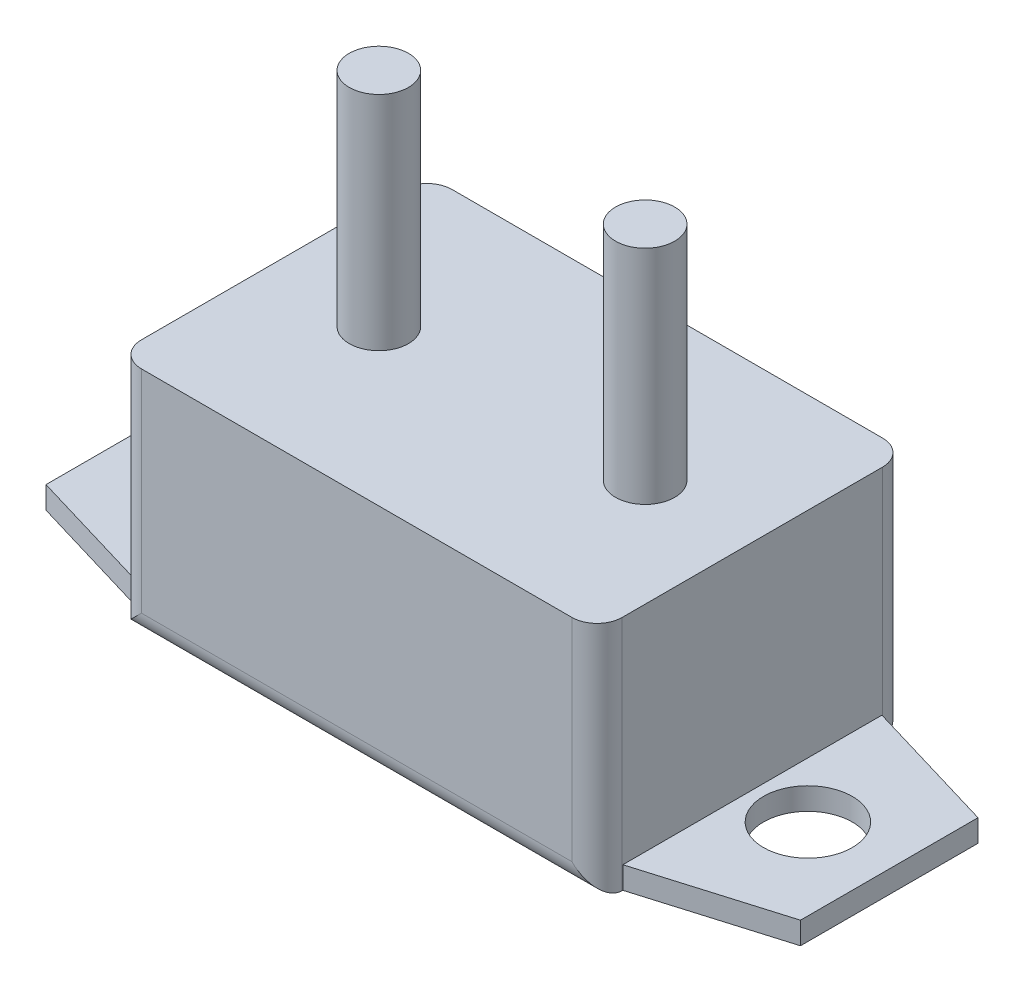
ISO-10303-21;
HEADER;
FILE_DESCRIPTION(('STEP AP214'),'2;1');
FILE_NAME('part.step','',(''),(''),'','','');
FILE_SCHEMA(('AUTOMOTIVE_DESIGN { 1 0 10303 214 1 1 1 1 }'));
ENDSEC;
DATA;
#1=APPLICATION_CONTEXT('core data for automotive mechanical design processes');
#2=APPLICATION_PROTOCOL_DEFINITION('international standard','automotive_design',2000,#1);
#3=PRODUCT_CONTEXT('',#1,'mechanical');
#4=PRODUCT('Part','Part','',(#3));
#5=PRODUCT_RELATED_PRODUCT_CATEGORY('part','',(#4));
#6=PRODUCT_DEFINITION_FORMATION('','',#4);
#7=PRODUCT_DEFINITION_CONTEXT('part definition',#1,'design');
#8=PRODUCT_DEFINITION('design','',#6,#7);
#9=PRODUCT_DEFINITION_SHAPE('','',#8);
#10=(LENGTH_UNIT() NAMED_UNIT(*) SI_UNIT(.MILLI.,.METRE.));
#11=(NAMED_UNIT(*) PLANE_ANGLE_UNIT() SI_UNIT($,.RADIAN.));
#12=(NAMED_UNIT(*) SI_UNIT($,.STERADIAN.) SOLID_ANGLE_UNIT());
#13=UNCERTAINTY_MEASURE_WITH_UNIT(LENGTH_MEASURE(1.E-05),#10,'distance_accuracy_value','');
#14=(GEOMETRIC_REPRESENTATION_CONTEXT(3) GLOBAL_UNCERTAINTY_ASSIGNED_CONTEXT((#13)) GLOBAL_UNIT_ASSIGNED_CONTEXT((#10,
#11,#12)) REPRESENTATION_CONTEXT('',''));
#15=CARTESIAN_POINT('',(0.,0.,0.));
#16=DIRECTION('',(0.,0.,1.));
#17=DIRECTION('',(1.,0.,0.));
#18=AXIS2_PLACEMENT_3D('',#15,#16,#17);
#19=CARTESIAN_POINT('',(16.25,16.,-10.5));
#20=DIRECTION('',(-1.,0.,0.));
#21=DIRECTION('',(0.,0.,1.));
#22=AXIS2_PLACEMENT_3D('',#19,#20,#21);
#23=PLANE('',#22);
#24=DIRECTION('',(0.,0.,-1.));
#25=VECTOR('',#24,1.);
#26=CARTESIAN_POINT('',(16.25,0.,-10.5));
#27=LINE('',#26,#25);
#28=CARTESIAN_POINT('',(16.25,0.,-8.7543022393316));
#29=VERTEX_POINT('',#28);
#30=CARTESIAN_POINT('',(16.25,0.,-8.8));
#31=VERTEX_POINT('',#30);
#32=EDGE_CURVE('E242',#29,#31,#27,.T.);
#33=ORIENTED_EDGE('',*,*,#32,.T.);
#34=DIRECTION('',(0.,-1.,0.));
#35=VECTOR('',#34,1.);
#36=CARTESIAN_POINT('',(16.25,16.,-8.8));
#37=LINE('',#36,#35);
#38=CARTESIAN_POINT('',(16.25,16.,-8.8));
#39=VERTEX_POINT('',#38);
#40=EDGE_CURVE('E280',#31,#39,#37,.F.);
#41=ORIENTED_EDGE('',*,*,#40,.T.);
#42=DIRECTION('',(0.,0.,-1.));
#43=VECTOR('',#42,1.);
#44=CARTESIAN_POINT('',(16.25,16.,-10.5));
#45=LINE('',#44,#43);
#46=CARTESIAN_POINT('',(16.25,16.,8.79999999999999));
#47=VERTEX_POINT('',#46);
#48=EDGE_CURVE('E245',#47,#39,#45,.T.);
#49=ORIENTED_EDGE('',*,*,#48,.F.);
#50=DIRECTION('',(0.,-1.,0.));
#51=VECTOR('',#50,1.);
#52=CARTESIAN_POINT('',(16.25,16.,8.8));
#53=LINE('',#52,#51);
#54=CARTESIAN_POINT('',(16.25,0.,8.79999999999999));
#55=VERTEX_POINT('',#54);
#56=EDGE_CURVE('E278',#47,#55,#53,.T.);
#57=ORIENTED_EDGE('',*,*,#56,.T.);
#58=CARTESIAN_POINT('',(16.25,0.,8.7543022393316));
#59=VERTEX_POINT('',#58);
#60=EDGE_CURVE('E257',#55,#59,#27,.T.);
#61=ORIENTED_EDGE('',*,*,#60,.T.);
#62=DIRECTION('',(0.,-1.,0.));
#63=VECTOR('',#62,1.);
#64=CARTESIAN_POINT('',(16.25,1.5,8.7543022393316));
#65=LINE('',#64,#63);
#66=CARTESIAN_POINT('',(16.25,1.5,8.7543022393316));
#67=VERTEX_POINT('',#66);
#68=EDGE_CURVE('E175',#67,#59,#65,.T.);
#69=ORIENTED_EDGE('',*,*,#68,.F.);
#70=DIRECTION('',(0.,0.,-1.));
#71=VECTOR('',#70,1.);
#72=CARTESIAN_POINT('',(16.25,1.5,8.7543022393316));
#73=LINE('',#72,#71);
#74=CARTESIAN_POINT('',(16.25,1.5,-8.7543022393316));
#75=VERTEX_POINT('',#74);
#76=EDGE_CURVE('E168',#67,#75,#73,.T.);
#77=ORIENTED_EDGE('',*,*,#76,.T.);
#78=DIRECTION('',(0.,-1.,0.));
#79=VECTOR('',#78,1.);
#80=CARTESIAN_POINT('',(16.25,1.5,-8.7543022393316));
#81=LINE('',#80,#79);
#82=EDGE_CURVE('E151',#75,#29,#81,.T.);
#83=ORIENTED_EDGE('',*,*,#82,.T.);
#84=EDGE_LOOP('',(#33,#41,#49,#57,#61,#69,#77,#83));
#85=FACE_BOUND('',#84,.T.);
#86=ADVANCED_FACE('F36',(#85),#23,.F.);
#87=CARTESIAN_POINT('',(-16.25,16.,-10.5));
#88=DIRECTION('',(1.,0.,0.));
#89=DIRECTION('',(0.,0.,-1.));
#90=AXIS2_PLACEMENT_3D('',#87,#88,#89);
#91=PLANE('',#90);
#92=DIRECTION('',(0.,0.,1.));
#93=VECTOR('',#92,1.);
#94=CARTESIAN_POINT('',(-16.25,16.,-10.5));
#95=LINE('',#94,#93);
#96=CARTESIAN_POINT('',(-16.25,16.,-8.8));
#97=VERTEX_POINT('',#96);
#98=CARTESIAN_POINT('',(-16.25,16.,8.79999999999999));
#99=VERTEX_POINT('',#98);
#100=EDGE_CURVE('E251',#97,#99,#95,.T.);
#101=ORIENTED_EDGE('',*,*,#100,.F.);
#102=DIRECTION('',(0.,-1.,0.));
#103=VECTOR('',#102,1.);
#104=CARTESIAN_POINT('',(-16.25,16.,-8.8));
#105=LINE('',#104,#103);
#106=CARTESIAN_POINT('',(-16.25,0.,-8.8));
#107=VERTEX_POINT('',#106);
#108=EDGE_CURVE('E11',#97,#107,#105,.T.);
#109=ORIENTED_EDGE('',*,*,#108,.T.);
#110=DIRECTION('',(0.,0.,1.));
#111=VECTOR('',#110,1.);
#112=CARTESIAN_POINT('',(-16.25,0.,-10.5));
#113=LINE('',#112,#111);
#114=CARTESIAN_POINT('',(-16.25,0.,-8.7543022393316));
#115=VERTEX_POINT('',#114);
#116=EDGE_CURVE('E249',#107,#115,#113,.T.);
#117=ORIENTED_EDGE('',*,*,#116,.T.);
#118=DIRECTION('',(0.,-1.,0.));
#119=VECTOR('',#118,1.);
#120=CARTESIAN_POINT('',(-16.25,1.5,-8.7543022393316));
#121=LINE('',#120,#119);
#122=CARTESIAN_POINT('',(-16.25,1.5,-8.7543022393316));
#123=VERTEX_POINT('',#122);
#124=EDGE_CURVE('E223',#123,#115,#121,.T.);
#125=ORIENTED_EDGE('',*,*,#124,.F.);
#126=DIRECTION('',(0.,0.,1.));
#127=VECTOR('',#126,1.);
#128=CARTESIAN_POINT('',(-16.25,1.5,8.7543022393316));
#129=LINE('',#128,#127);
#130=CARTESIAN_POINT('',(-16.25,1.5,8.7543022393316));
#131=VERTEX_POINT('',#130);
#132=EDGE_CURVE('E202',#123,#131,#129,.T.);
#133=ORIENTED_EDGE('',*,*,#132,.T.);
#134=DIRECTION('',(0.,-1.,0.));
#135=VECTOR('',#134,1.);
#136=CARTESIAN_POINT('',(-16.25,1.5,8.7543022393316));
#137=LINE('',#136,#135);
#138=CARTESIAN_POINT('',(-16.25,0.,8.75430223933159));
#139=VERTEX_POINT('',#138);
#140=EDGE_CURVE('E215',#131,#139,#137,.T.);
#141=ORIENTED_EDGE('',*,*,#140,.T.);
#142=CARTESIAN_POINT('',(-16.25,0.,8.79999999999999));
#143=VERTEX_POINT('',#142);
#144=EDGE_CURVE('E259',#139,#143,#113,.T.);
#145=ORIENTED_EDGE('',*,*,#144,.T.);
#146=DIRECTION('',(0.,-1.,0.));
#147=VECTOR('',#146,1.);
#148=CARTESIAN_POINT('',(-16.25,16.,8.8));
#149=LINE('',#148,#147);
#150=EDGE_CURVE('E45',#143,#99,#149,.F.);
#151=ORIENTED_EDGE('',*,*,#150,.T.);
#152=EDGE_LOOP('',(#101,#109,#117,#125,#133,#141,#145,#151));
#153=FACE_BOUND('',#152,.T.);
#154=ADVANCED_FACE('F335',(#153),#91,.F.);
#155=CARTESIAN_POINT('',(-16.25,16.,-10.5));
#156=DIRECTION('',(0.,0.,1.));
#157=DIRECTION('',(1.,0.,0.));
#158=AXIS2_PLACEMENT_3D('',#155,#156,#157);
#159=PLANE('',#158);
#160=DIRECTION('',(-1.,0.,0.));
#161=VECTOR('',#160,1.);
#162=CARTESIAN_POINT('',(-16.25,16.,-10.5));
#163=LINE('',#162,#161);
#164=CARTESIAN_POINT('',(14.55,16.,-10.5));
#165=VERTEX_POINT('',#164);
#166=CARTESIAN_POINT('',(-14.55,16.,-10.5));
#167=VERTEX_POINT('',#166);
#168=EDGE_CURVE('E248',#165,#167,#163,.T.);
#169=ORIENTED_EDGE('',*,*,#168,.F.);
#170=DIRECTION('',(0.,-1.,0.));
#171=VECTOR('',#170,1.);
#172=CARTESIAN_POINT('',(14.55,16.,-10.5));
#173=LINE('',#172,#171);
#174=CARTESIAN_POINT('',(14.55,1.7,-10.5));
#175=VERTEX_POINT('',#174);
#176=EDGE_CURVE('E265',#165,#175,#173,.T.);
#177=ORIENTED_EDGE('',*,*,#176,.T.);
#178=DIRECTION('',(-1.,0.,0.));
#179=VECTOR('',#178,1.);
#180=CARTESIAN_POINT('',(-16.25,1.7,-10.5));
#181=LINE('',#180,#179);
#182=CARTESIAN_POINT('',(-14.55,1.7,-10.5));
#183=VERTEX_POINT('',#182);
#184=EDGE_CURVE('E262',#175,#183,#181,.T.);
#185=ORIENTED_EDGE('',*,*,#184,.T.);
#186=DIRECTION('',(0.,-1.,0.));
#187=VECTOR('',#186,1.);
#188=CARTESIAN_POINT('',(-14.55,16.,-10.5));
#189=LINE('',#188,#187);
#190=EDGE_CURVE('E256',#183,#167,#189,.F.);
#191=ORIENTED_EDGE('',*,*,#190,.T.);
#192=EDGE_LOOP('',(#169,#177,#185,#191));
#193=FACE_BOUND('',#192,.T.);
#194=ADVANCED_FACE('F330',(#193),#159,.F.);
#195=CARTESIAN_POINT('',(-16.25,16.,10.5));
#196=DIRECTION('',(0.,0.,-1.));
#197=DIRECTION('',(-1.,0.,0.));
#198=AXIS2_PLACEMENT_3D('',#195,#196,#197);
#199=PLANE('',#198);
#200=DIRECTION('',(1.,0.,0.));
#201=VECTOR('',#200,1.);
#202=CARTESIAN_POINT('',(-16.25,1.7,10.5));
#203=LINE('',#202,#201);
#204=CARTESIAN_POINT('',(-14.55,1.7,10.5));
#205=VERTEX_POINT('',#204);
#206=CARTESIAN_POINT('',(14.55,1.7,10.5));
#207=VERTEX_POINT('',#206);
#208=EDGE_CURVE('E273',#205,#207,#203,.T.);
#209=ORIENTED_EDGE('',*,*,#208,.T.);
#210=DIRECTION('',(0.,-1.,0.));
#211=VECTOR('',#210,1.);
#212=CARTESIAN_POINT('',(14.55,16.,10.5));
#213=LINE('',#212,#211);
#214=CARTESIAN_POINT('',(14.55,16.,10.5));
#215=VERTEX_POINT('',#214);
#216=EDGE_CURVE('E276',#207,#215,#213,.F.);
#217=ORIENTED_EDGE('',*,*,#216,.T.);
#218=DIRECTION('',(1.,0.,0.));
#219=VECTOR('',#218,1.);
#220=CARTESIAN_POINT('',(-16.25,16.,10.5));
#221=LINE('',#220,#219);
#222=CARTESIAN_POINT('',(-14.55,16.,10.5));
#223=VERTEX_POINT('',#222);
#224=EDGE_CURVE('E253',#223,#215,#221,.T.);
#225=ORIENTED_EDGE('',*,*,#224,.F.);
#226=DIRECTION('',(0.,-1.,0.));
#227=VECTOR('',#226,1.);
#228=CARTESIAN_POINT('',(-14.55,16.,10.5));
#229=LINE('',#228,#227);
#230=EDGE_CURVE('E271',#223,#205,#229,.T.);
#231=ORIENTED_EDGE('',*,*,#230,.T.);
#232=EDGE_LOOP('',(#209,#217,#225,#231));
#233=FACE_BOUND('',#232,.T.);
#234=ADVANCED_FACE('F310',(#233),#199,.F.);
#235=CARTESIAN_POINT('',(0.,16.,0.));
#236=DIRECTION('',(0.,1.,0.));
#237=DIRECTION('',(0.,0.,1.));
#238=AXIS2_PLACEMENT_3D('',#235,#236,#237);
#239=PLANE('',#238);
#240=CARTESIAN_POINT('',(9.,16.,0.));
#241=DIRECTION('',(0.,1.,0.));
#242=DIRECTION('',(0.,0.,-1.));
#243=AXIS2_PLACEMENT_3D('',#240,#241,#242);
#244=CIRCLE('',#243,2.);
#245=CARTESIAN_POINT('',(9.,16.,-2.));
#246=VERTEX_POINT('',#245);
#247=EDGE_CURVE('E226',#246,#246,#244,.T.);
#248=ORIENTED_EDGE('',*,*,#247,.F.);
#249=EDGE_LOOP('',(#248));
#250=FACE_BOUND('',#249,.T.);
#251=CARTESIAN_POINT('',(-9.,16.,0.));
#252=DIRECTION('',(0.,1.,0.));
#253=DIRECTION('',(0.,0.,1.));
#254=AXIS2_PLACEMENT_3D('',#251,#252,#253);
#255=CIRCLE('',#254,2.);
#256=CARTESIAN_POINT('',(-9.,16.,2.));
#257=VERTEX_POINT('',#256);
#258=EDGE_CURVE('E236',#257,#257,#255,.T.);
#259=ORIENTED_EDGE('',*,*,#258,.F.);
#260=EDGE_LOOP('',(#259));
#261=FACE_BOUND('',#260,.T.);
#262=ORIENTED_EDGE('',*,*,#48,.T.);
#263=CARTESIAN_POINT('',(14.55,16.,-8.8));
#264=DIRECTION('',(0.,1.,0.));
#265=DIRECTION('',(0.,0.,1.));
#266=AXIS2_PLACEMENT_3D('',#263,#264,#265);
#267=CIRCLE('',#266,1.7);
#268=EDGE_CURVE('E287',#39,#165,#267,.T.);
#269=ORIENTED_EDGE('',*,*,#268,.T.);
#270=ORIENTED_EDGE('',*,*,#168,.T.);
#271=CARTESIAN_POINT('',(-14.55,16.,-8.8));
#272=DIRECTION('',(0.,1.,0.));
#273=DIRECTION('',(0.,0.,1.));
#274=AXIS2_PLACEMENT_3D('',#271,#272,#273);
#275=CIRCLE('',#274,1.7);
#276=EDGE_CURVE('E59',#167,#97,#275,.T.);
#277=ORIENTED_EDGE('',*,*,#276,.T.);
#278=ORIENTED_EDGE('',*,*,#100,.T.);
#279=CARTESIAN_POINT('',(-14.55,16.,8.8));
#280=DIRECTION('',(0.,1.,0.));
#281=DIRECTION('',(0.,0.,1.));
#282=AXIS2_PLACEMENT_3D('',#279,#280,#281);
#283=CIRCLE('',#282,1.7);
#284=EDGE_CURVE('E282',#99,#223,#283,.T.);
#285=ORIENTED_EDGE('',*,*,#284,.T.);
#286=ORIENTED_EDGE('',*,*,#224,.T.);
#287=CARTESIAN_POINT('',(14.55,16.,8.8));
#288=DIRECTION('',(0.,1.,0.));
#289=DIRECTION('',(0.,0.,1.));
#290=AXIS2_PLACEMENT_3D('',#287,#288,#289);
#291=CIRCLE('',#290,1.7);
#292=EDGE_CURVE('E285',#215,#47,#291,.T.);
#293=ORIENTED_EDGE('',*,*,#292,.T.);
#294=EDGE_LOOP('',(#262,#269,#270,#277,#278,#285,#286,#293));
#295=FACE_BOUND('',#294,.T.);
#296=ADVANCED_FACE('F307',(#250,#261,#295),#239,.T.);
#297=CARTESIAN_POINT('',(0.,0.,0.));
#298=DIRECTION('',(0.,1.,0.));
#299=DIRECTION('',(0.,0.,1.));
#300=AXIS2_PLACEMENT_3D('',#297,#298,#299);
#301=PLANE('',#300);
#302=ORIENTED_EDGE('',*,*,#116,.F.);
#303=DIRECTION('',(-1.,0.,0.));
#304=VECTOR('',#303,1.);
#305=CARTESIAN_POINT('',(0.,0.,-8.8));
#306=LINE('',#305,#304);
#307=EDGE_CURVE('E269',#107,#31,#306,.F.);
#308=ORIENTED_EDGE('',*,*,#307,.T.);
#309=ORIENTED_EDGE('',*,*,#32,.F.);
#310=DIRECTION('',(0.958414506055737,0.,0.285379807593211));
#311=VECTOR('',#310,1.);
#312=CARTESIAN_POINT('',(16.25,0.,-8.7543022393316));
#313=LINE('',#312,#311);
#314=CARTESIAN_POINT('',(25.5,0.,-6.));
#315=VERTEX_POINT('',#314);
#316=EDGE_CURVE('E156',#29,#315,#313,.T.);
#317=ORIENTED_EDGE('',*,*,#316,.T.);
#318=DIRECTION('',(0.,0.,1.));
#319=VECTOR('',#318,1.);
#320=CARTESIAN_POINT('',(25.5,0.,6.));
#321=LINE('',#320,#319);
#322=CARTESIAN_POINT('',(25.5,0.,6.));
#323=VERTEX_POINT('',#322);
#324=EDGE_CURVE('E179',#315,#323,#321,.T.);
#325=ORIENTED_EDGE('',*,*,#324,.T.);
#326=DIRECTION('',(-0.958414506055737,0.,0.285379807593211));
#327=VECTOR('',#326,1.);
#328=CARTESIAN_POINT('',(16.25,0.,8.7543022393316));
#329=LINE('',#328,#327);
#330=EDGE_CURVE('E176',#323,#59,#329,.T.);
#331=ORIENTED_EDGE('',*,*,#330,.T.);
#332=ORIENTED_EDGE('',*,*,#60,.F.);
#333=DIRECTION('',(1.,0.,0.));
#334=VECTOR('',#333,1.);
#335=CARTESIAN_POINT('',(0.,0.,8.8));
#336=LINE('',#335,#334);
#337=EDGE_CURVE('E267',#55,#143,#336,.F.);
#338=ORIENTED_EDGE('',*,*,#337,.T.);
#339=ORIENTED_EDGE('',*,*,#144,.F.);
#340=DIRECTION('',(-0.958414506055737,0.,-0.285379807593212));
#341=VECTOR('',#340,1.);
#342=CARTESIAN_POINT('',(-16.25,0.,8.7543022393316));
#343=LINE('',#342,#341);
#344=CARTESIAN_POINT('',(-25.5,0.,5.99999999999999));
#345=VERTEX_POINT('',#344);
#346=EDGE_CURVE('E199',#139,#345,#343,.T.);
#347=ORIENTED_EDGE('',*,*,#346,.T.);
#348=DIRECTION('',(0.,0.,-1.));
#349=VECTOR('',#348,1.);
#350=CARTESIAN_POINT('',(-25.5,0.,5.99999999999999));
#351=LINE('',#350,#349);
#352=CARTESIAN_POINT('',(-25.5,0.,-5.99999999999999));
#353=VERTEX_POINT('',#352);
#354=EDGE_CURVE('E218',#345,#353,#351,.T.);
#355=ORIENTED_EDGE('',*,*,#354,.T.);
#356=DIRECTION('',(0.958414506055737,0.,-0.285379807593212));
#357=VECTOR('',#356,1.);
#358=CARTESIAN_POINT('',(-16.25,0.,-8.7543022393316));
#359=LINE('',#358,#357);
#360=EDGE_CURVE('E206',#353,#115,#359,.T.);
#361=ORIENTED_EDGE('',*,*,#360,.T.);
#362=EDGE_LOOP('',(#302,#308,#309,#317,#325,#331,#332,#338,#339,#347,#355,#361));
#363=FACE_BOUND('',#362,.T.);
#364=CARTESIAN_POINT('',(-20.,0.,0.));
#365=DIRECTION('',(0.,-1.,0.));
#366=DIRECTION('',(0.,0.,-1.));
#367=AXIS2_PLACEMENT_3D('',#364,#365,#366);
#368=CIRCLE('',#367,3.);
#369=CARTESIAN_POINT('',(-20.,0.,-3.));
#370=VERTEX_POINT('',#369);
#371=EDGE_CURVE('E192',#370,#370,#368,.T.);
#372=ORIENTED_EDGE('',*,*,#371,.F.);
#373=EDGE_LOOP('',(#372));
#374=FACE_BOUND('',#373,.T.);
#375=CARTESIAN_POINT('',(20.,0.,0.));
#376=DIRECTION('',(0.,-1.,0.));
#377=DIRECTION('',(0.,0.,1.));
#378=AXIS2_PLACEMENT_3D('',#375,#376,#377);
#379=CIRCLE('',#378,3.);
#380=CARTESIAN_POINT('',(20.,0.,3.));
#381=VERTEX_POINT('',#380);
#382=EDGE_CURVE('E182',#381,#381,#379,.T.);
#383=ORIENTED_EDGE('',*,*,#382,.F.);
#384=EDGE_LOOP('',(#383));
#385=FACE_BOUND('',#384,.T.);
#386=ADVANCED_FACE('F338',(#363,#374,#385),#301,.F.);
#387=CARTESIAN_POINT('',(-9.,31.,0.));
#388=DIRECTION('',(0.,-1.,0.));
#389=DIRECTION('',(0.,0.,-1.));
#390=AXIS2_PLACEMENT_3D('',#387,#388,#389);
#391=CYLINDRICAL_SURFACE('',#390,2.);
#392=CARTESIAN_POINT('',(-9.,31.,0.));
#393=DIRECTION('',(0.,1.,0.));
#394=DIRECTION('',(0.,0.,1.));
#395=AXIS2_PLACEMENT_3D('',#392,#393,#394);
#396=CIRCLE('',#395,2.);
#397=CARTESIAN_POINT('',(-9.,31.,2.));
#398=VERTEX_POINT('',#397);
#399=EDGE_CURVE('E239',#398,#398,#396,.T.);
#400=ORIENTED_EDGE('',*,*,#399,.F.);
#401=EDGE_LOOP('',(#400));
#402=FACE_BOUND('',#401,.T.);
#403=ORIENTED_EDGE('',*,*,#258,.T.);
#404=EDGE_LOOP('',(#403));
#405=FACE_BOUND('',#404,.T.);
#406=ADVANCED_FACE('F510',(#402,#405),#391,.T.);
#407=CARTESIAN_POINT('',(-9.,31.,0.));
#408=DIRECTION('',(0.,1.,0.));
#409=DIRECTION('',(0.,0.,1.));
#410=AXIS2_PLACEMENT_3D('',#407,#408,#409);
#411=PLANE('',#410);
#412=ORIENTED_EDGE('',*,*,#399,.T.);
#413=EDGE_LOOP('',(#412));
#414=FACE_BOUND('',#413,.T.);
#415=ADVANCED_FACE('F499',(#414),#411,.T.);
#416=CARTESIAN_POINT('',(9.,31.,0.));
#417=DIRECTION('',(0.,-1.,0.));
#418=DIRECTION('',(0.,0.,-1.));
#419=AXIS2_PLACEMENT_3D('',#416,#417,#418);
#420=CYLINDRICAL_SURFACE('',#419,2.);
#421=CARTESIAN_POINT('',(9.,31.,0.));
#422=DIRECTION('',(0.,1.,0.));
#423=DIRECTION('',(0.,0.,-1.));
#424=AXIS2_PLACEMENT_3D('',#421,#422,#423);
#425=CIRCLE('',#424,2.);
#426=CARTESIAN_POINT('',(9.,31.,-2.));
#427=VERTEX_POINT('',#426);
#428=EDGE_CURVE('E233',#427,#427,#425,.T.);
#429=ORIENTED_EDGE('',*,*,#428,.F.);
#430=EDGE_LOOP('',(#429));
#431=FACE_BOUND('',#430,.T.);
#432=ORIENTED_EDGE('',*,*,#247,.T.);
#433=EDGE_LOOP('',(#432));
#434=FACE_BOUND('',#433,.T.);
#435=ADVANCED_FACE('F486',(#431,#434),#420,.T.);
#436=CARTESIAN_POINT('',(9.,31.,0.));
#437=DIRECTION('',(0.,-1.,0.));
#438=DIRECTION('',(0.,0.,-1.));
#439=AXIS2_PLACEMENT_3D('',#436,#437,#438);
#440=PLANE('',#439);
#441=ORIENTED_EDGE('',*,*,#428,.T.);
#442=EDGE_LOOP('',(#441));
#443=FACE_BOUND('',#442,.T.);
#444=ADVANCED_FACE('F475',(#443),#440,.F.);
#445=CARTESIAN_POINT('',(-16.25,1.5,-8.7543022393316));
#446=DIRECTION('',(-0.285379807593212,0.,-0.958414506055736));
#447=DIRECTION('',(-0.958414506055737,0.,0.285379807593212));
#448=AXIS2_PLACEMENT_3D('',#445,#446,#447);
#449=PLANE('',#448);
#450=ORIENTED_EDGE('',*,*,#360,.F.);
#451=DIRECTION('',(0.,-1.,0.));
#452=VECTOR('',#451,1.);
#453=CARTESIAN_POINT('',(-25.5,1.5,-5.99999999999999));
#454=LINE('',#453,#452);
#455=CARTESIAN_POINT('',(-25.5,1.5,-5.99999999999999));
#456=VERTEX_POINT('',#455);
#457=EDGE_CURVE('E227',#456,#353,#454,.T.);
#458=ORIENTED_EDGE('',*,*,#457,.F.);
#459=DIRECTION('',(0.958414506055737,0.,-0.285379807593212));
#460=VECTOR('',#459,1.);
#461=CARTESIAN_POINT('',(-16.25,1.5,-8.7543022393316));
#462=LINE('',#461,#460);
#463=EDGE_CURVE('E212',#456,#123,#462,.T.);
#464=ORIENTED_EDGE('',*,*,#463,.T.);
#465=ORIENTED_EDGE('',*,*,#124,.T.);
#466=EDGE_LOOP('',(#450,#458,#464,#465));
#467=FACE_BOUND('',#466,.T.);
#468=ADVANCED_FACE('F343',(#467),#449,.T.);
#469=CARTESIAN_POINT('',(-25.5,1.5,5.99999999999999));
#470=DIRECTION('',(-1.,0.,0.));
#471=DIRECTION('',(0.,0.,1.));
#472=AXIS2_PLACEMENT_3D('',#469,#470,#471);
#473=PLANE('',#472);
#474=ORIENTED_EDGE('',*,*,#354,.F.);
#475=DIRECTION('',(0.,-1.,0.));
#476=VECTOR('',#475,1.);
#477=CARTESIAN_POINT('',(-25.5,1.5,5.99999999999999));
#478=LINE('',#477,#476);
#479=CARTESIAN_POINT('',(-25.5,1.5,5.99999999999999));
#480=VERTEX_POINT('',#479);
#481=EDGE_CURVE('E229',#480,#345,#478,.T.);
#482=ORIENTED_EDGE('',*,*,#481,.F.);
#483=DIRECTION('',(0.,0.,-1.));
#484=VECTOR('',#483,1.);
#485=CARTESIAN_POINT('',(-25.5,1.5,5.99999999999999));
#486=LINE('',#485,#484);
#487=EDGE_CURVE('E209',#480,#456,#486,.T.);
#488=ORIENTED_EDGE('',*,*,#487,.T.);
#489=ORIENTED_EDGE('',*,*,#457,.T.);
#490=EDGE_LOOP('',(#474,#482,#488,#489));
#491=FACE_BOUND('',#490,.T.);
#492=ADVANCED_FACE('F457',(#491),#473,.T.);
#493=CARTESIAN_POINT('',(-16.25,1.5,8.7543022393316));
#494=DIRECTION('',(-0.285379807593212,0.,0.958414506055736));
#495=DIRECTION('',(0.958414506055737,0.,0.285379807593212));
#496=AXIS2_PLACEMENT_3D('',#493,#494,#495);
#497=PLANE('',#496);
#498=ORIENTED_EDGE('',*,*,#346,.F.);
#499=ORIENTED_EDGE('',*,*,#140,.F.);
#500=DIRECTION('',(-0.958414506055737,0.,-0.285379807593212));
#501=VECTOR('',#500,1.);
#502=CARTESIAN_POINT('',(-16.25,1.5,8.7543022393316));
#503=LINE('',#502,#501);
#504=EDGE_CURVE('E205',#131,#480,#503,.T.);
#505=ORIENTED_EDGE('',*,*,#504,.T.);
#506=ORIENTED_EDGE('',*,*,#481,.T.);
#507=EDGE_LOOP('',(#498,#499,#505,#506));
#508=FACE_BOUND('',#507,.T.);
#509=ADVANCED_FACE('F351',(#508),#497,.T.);
#510=CARTESIAN_POINT('',(0.,1.5,0.));
#511=DIRECTION('',(0.,1.,0.));
#512=DIRECTION('',(0.,0.,1.));
#513=AXIS2_PLACEMENT_3D('',#510,#511,#512);
#514=PLANE('',#513);
#515=CARTESIAN_POINT('',(-20.,1.5,0.));
#516=DIRECTION('',(0.,-1.,0.));
#517=DIRECTION('',(0.,0.,-1.));
#518=AXIS2_PLACEMENT_3D('',#515,#516,#517);
#519=CIRCLE('',#518,3.);
#520=CARTESIAN_POINT('',(-20.,1.5,-3.));
#521=VERTEX_POINT('',#520);
#522=EDGE_CURVE('E196',#521,#521,#519,.T.);
#523=ORIENTED_EDGE('',*,*,#522,.T.);
#524=EDGE_LOOP('',(#523));
#525=FACE_BOUND('',#524,.T.);
#526=ORIENTED_EDGE('',*,*,#132,.F.);
#527=ORIENTED_EDGE('',*,*,#463,.F.);
#528=ORIENTED_EDGE('',*,*,#487,.F.);
#529=ORIENTED_EDGE('',*,*,#504,.F.);
#530=EDGE_LOOP('',(#526,#527,#528,#529));
#531=FACE_BOUND('',#530,.T.);
#532=ADVANCED_FACE('F348',(#525,#531),#514,.T.);
#533=CARTESIAN_POINT('',(-20.,1.5,0.));
#534=DIRECTION('',(0.,-1.,0.));
#535=DIRECTION('',(0.,0.,-1.));
#536=AXIS2_PLACEMENT_3D('',#533,#534,#535);
#537=CYLINDRICAL_SURFACE('',#536,3.);
#538=ORIENTED_EDGE('',*,*,#522,.F.);
#539=EDGE_LOOP('',(#538));
#540=FACE_BOUND('',#539,.T.);
#541=ORIENTED_EDGE('',*,*,#371,.T.);
#542=EDGE_LOOP('',(#541));
#543=FACE_BOUND('',#542,.T.);
#544=ADVANCED_FACE('F365',(#540,#543),#537,.F.);
#545=CARTESIAN_POINT('',(16.25,1.5,8.7543022393316));
#546=DIRECTION('',(0.285379807593211,0.,0.958414506055737));
#547=DIRECTION('',(0.958414506055737,0.,-0.285379807593211));
#548=AXIS2_PLACEMENT_3D('',#545,#546,#547);
#549=PLANE('',#548);
#550=ORIENTED_EDGE('',*,*,#330,.F.);
#551=DIRECTION('',(0.,-1.,0.));
#552=VECTOR('',#551,1.);
#553=CARTESIAN_POINT('',(25.5,1.5,6.));
#554=LINE('',#553,#552);
#555=CARTESIAN_POINT('',(25.5,1.5,6.));
#556=VERTEX_POINT('',#555);
#557=EDGE_CURVE('E193',#556,#323,#554,.T.);
#558=ORIENTED_EDGE('',*,*,#557,.F.);
#559=DIRECTION('',(-0.958414506055737,0.,0.285379807593211));
#560=VECTOR('',#559,1.);
#561=CARTESIAN_POINT('',(16.25,1.5,8.7543022393316));
#562=LINE('',#561,#560);
#563=EDGE_CURVE('E162',#556,#67,#562,.T.);
#564=ORIENTED_EDGE('',*,*,#563,.T.);
#565=ORIENTED_EDGE('',*,*,#68,.T.);
#566=EDGE_LOOP('',(#550,#558,#564,#565));
#567=FACE_BOUND('',#566,.T.);
#568=ADVANCED_FACE('F354',(#567),#549,.T.);
#569=CARTESIAN_POINT('',(25.5,1.5,6.));
#570=DIRECTION('',(1.,0.,0.));
#571=DIRECTION('',(0.,0.,-1.));
#572=AXIS2_PLACEMENT_3D('',#569,#570,#571);
#573=PLANE('',#572);
#574=ORIENTED_EDGE('',*,*,#324,.F.);
#575=DIRECTION('',(0.,-1.,0.));
#576=VECTOR('',#575,1.);
#577=CARTESIAN_POINT('',(25.5,1.5,-6.));
#578=LINE('',#577,#576);
#579=CARTESIAN_POINT('',(25.5,1.5,-6.));
#580=VERTEX_POINT('',#579);
#581=EDGE_CURVE('E161',#580,#315,#578,.T.);
#582=ORIENTED_EDGE('',*,*,#581,.F.);
#583=DIRECTION('',(0.,0.,1.));
#584=VECTOR('',#583,1.);
#585=CARTESIAN_POINT('',(25.5,1.5,6.));
#586=LINE('',#585,#584);
#587=EDGE_CURVE('E171',#580,#556,#586,.T.);
#588=ORIENTED_EDGE('',*,*,#587,.T.);
#589=ORIENTED_EDGE('',*,*,#557,.T.);
#590=EDGE_LOOP('',(#574,#582,#588,#589));
#591=FACE_BOUND('',#590,.T.);
#592=ADVANCED_FACE('F357',(#591),#573,.T.);
#593=CARTESIAN_POINT('',(16.25,1.5,-8.7543022393316));
#594=DIRECTION('',(0.285379807593211,0.,-0.958414506055737));
#595=DIRECTION('',(-0.958414506055737,0.,-0.285379807593211));
#596=AXIS2_PLACEMENT_3D('',#593,#594,#595);
#597=PLANE('',#596);
#598=ORIENTED_EDGE('',*,*,#316,.F.);
#599=ORIENTED_EDGE('',*,*,#82,.F.);
#600=DIRECTION('',(0.958414506055737,0.,0.285379807593211));
#601=VECTOR('',#600,1.);
#602=CARTESIAN_POINT('',(16.25,1.5,-8.7543022393316));
#603=LINE('',#602,#601);
#604=EDGE_CURVE('E154',#75,#580,#603,.T.);
#605=ORIENTED_EDGE('',*,*,#604,.T.);
#606=ORIENTED_EDGE('',*,*,#581,.T.);
#607=EDGE_LOOP('',(#598,#599,#605,#606));
#608=FACE_BOUND('',#607,.T.);
#609=ADVANCED_FACE('F153',(#608),#597,.T.);
#610=CARTESIAN_POINT('',(0.,1.5,0.));
#611=DIRECTION('',(0.,-1.,0.));
#612=DIRECTION('',(0.,0.,-1.));
#613=AXIS2_PLACEMENT_3D('',#610,#611,#612);
#614=PLANE('',#613);
#615=CARTESIAN_POINT('',(20.,1.5,0.));
#616=DIRECTION('',(0.,-1.,0.));
#617=DIRECTION('',(0.,0.,1.));
#618=AXIS2_PLACEMENT_3D('',#615,#616,#617);
#619=CIRCLE('',#618,3.);
#620=CARTESIAN_POINT('',(20.,1.5,3.));
#621=VERTEX_POINT('',#620);
#622=EDGE_CURVE('E188',#621,#621,#619,.T.);
#623=ORIENTED_EDGE('',*,*,#622,.T.);
#624=EDGE_LOOP('',(#623));
#625=FACE_BOUND('',#624,.T.);
#626=ORIENTED_EDGE('',*,*,#76,.F.);
#627=ORIENTED_EDGE('',*,*,#563,.F.);
#628=ORIENTED_EDGE('',*,*,#587,.F.);
#629=ORIENTED_EDGE('',*,*,#604,.F.);
#630=EDGE_LOOP('',(#626,#627,#628,#629));
#631=FACE_BOUND('',#630,.T.);
#632=ADVANCED_FACE('F166',(#625,#631),#614,.F.);
#633=CARTESIAN_POINT('',(20.,1.5,0.));
#634=DIRECTION('',(0.,-1.,0.));
#635=DIRECTION('',(0.,0.,-1.));
#636=AXIS2_PLACEMENT_3D('',#633,#634,#635);
#637=CYLINDRICAL_SURFACE('',#636,3.);
#638=ORIENTED_EDGE('',*,*,#622,.F.);
#639=EDGE_LOOP('',(#638));
#640=FACE_BOUND('',#639,.T.);
#641=ORIENTED_EDGE('',*,*,#382,.T.);
#642=EDGE_LOOP('',(#641));
#643=FACE_BOUND('',#642,.T.);
#644=ADVANCED_FACE('F381',(#640,#643),#637,.F.);
#645=CARTESIAN_POINT('',(14.55,16.,-8.8));
#646=DIRECTION('',(0.,-1.,0.));
#647=DIRECTION('',(0.,0.,-1.));
#648=AXIS2_PLACEMENT_3D('',#645,#646,#647);
#649=CYLINDRICAL_SURFACE('',#648,1.7);
#650=ORIENTED_EDGE('',*,*,#268,.F.);
#651=ORIENTED_EDGE('',*,*,#40,.F.);
#652=CARTESIAN_POINT('',(14.55,1.7,-8.8));
#653=DIRECTION('',(-0.707106781186547,-0.707106781186547,0.));
#654=DIRECTION('',(0.707106781186547,-0.707106781186547,0.));
#655=AXIS2_PLACEMENT_3D('',#652,#653,#654);
#656=ELLIPSE('',#655,2.40416305603426,1.7);
#657=EDGE_CURVE('E292',#175,#31,#656,.T.);
#658=ORIENTED_EDGE('',*,*,#657,.F.);
#659=ORIENTED_EDGE('',*,*,#176,.F.);
#660=EDGE_LOOP('',(#650,#651,#658,#659));
#661=FACE_BOUND('',#660,.T.);
#662=ADVANCED_FACE('F320',(#661),#649,.T.);
#663=CARTESIAN_POINT('',(-14.55,16.,-8.8));
#664=DIRECTION('',(0.,-1.,0.));
#665=DIRECTION('',(0.,0.,-1.));
#666=AXIS2_PLACEMENT_3D('',#663,#664,#665);
#667=CYLINDRICAL_SURFACE('',#666,1.7);
#668=ORIENTED_EDGE('',*,*,#276,.F.);
#669=ORIENTED_EDGE('',*,*,#190,.F.);
#670=CARTESIAN_POINT('',(-14.55,1.7,-8.8));
#671=DIRECTION('',(0.707106781186547,-0.707106781186547,0.));
#672=DIRECTION('',(-0.707106781186547,-0.707106781186547,0.));
#673=AXIS2_PLACEMENT_3D('',#670,#671,#672);
#674=ELLIPSE('',#673,2.40416305603426,1.7);
#675=EDGE_CURVE('E290',#107,#183,#674,.T.);
#676=ORIENTED_EDGE('',*,*,#675,.F.);
#677=ORIENTED_EDGE('',*,*,#108,.F.);
#678=EDGE_LOOP('',(#668,#669,#676,#677));
#679=FACE_BOUND('',#678,.T.);
#680=ADVANCED_FACE('F333',(#679),#667,.T.);
#681=CARTESIAN_POINT('',(-16.25,1.7,-8.8));
#682=DIRECTION('',(-1.,0.,0.));
#683=DIRECTION('',(0.,0.,1.));
#684=AXIS2_PLACEMENT_3D('',#681,#682,#683);
#685=CYLINDRICAL_SURFACE('',#684,1.7);
#686=ORIENTED_EDGE('',*,*,#657,.T.);
#687=ORIENTED_EDGE('',*,*,#307,.F.);
#688=ORIENTED_EDGE('',*,*,#675,.T.);
#689=ORIENTED_EDGE('',*,*,#184,.F.);
#690=EDGE_LOOP('',(#686,#687,#688,#689));
#691=FACE_BOUND('',#690,.T.);
#692=ADVANCED_FACE('F325',(#691),#685,.T.);
#693=CARTESIAN_POINT('',(-14.55,16.,8.8));
#694=DIRECTION('',(0.,-1.,0.));
#695=DIRECTION('',(0.,0.,-1.));
#696=AXIS2_PLACEMENT_3D('',#693,#694,#695);
#697=CYLINDRICAL_SURFACE('',#696,1.7);
#698=ORIENTED_EDGE('',*,*,#284,.F.);
#699=ORIENTED_EDGE('',*,*,#150,.F.);
#700=CARTESIAN_POINT('',(-14.55,1.7,8.8));
#701=DIRECTION('',(0.707106781186547,-0.707106781186547,0.));
#702=DIRECTION('',(-0.707106781186547,-0.707106781186547,0.));
#703=AXIS2_PLACEMENT_3D('',#700,#701,#702);
#704=ELLIPSE('',#703,2.40416305603426,1.7);
#705=EDGE_CURVE('E40',#205,#143,#704,.T.);
#706=ORIENTED_EDGE('',*,*,#705,.F.);
#707=ORIENTED_EDGE('',*,*,#230,.F.);
#708=EDGE_LOOP('',(#698,#699,#706,#707));
#709=FACE_BOUND('',#708,.T.);
#710=ADVANCED_FACE('F38',(#709),#697,.T.);
#711=CARTESIAN_POINT('',(14.55,16.,8.8));
#712=DIRECTION('',(0.,-1.,0.));
#713=DIRECTION('',(0.,0.,-1.));
#714=AXIS2_PLACEMENT_3D('',#711,#712,#713);
#715=CYLINDRICAL_SURFACE('',#714,1.7);
#716=ORIENTED_EDGE('',*,*,#292,.F.);
#717=ORIENTED_EDGE('',*,*,#216,.F.);
#718=CARTESIAN_POINT('',(14.55,1.7,8.8));
#719=DIRECTION('',(-0.707106781186547,-0.707106781186547,0.));
#720=DIRECTION('',(0.707106781186547,-0.707106781186547,0.));
#721=AXIS2_PLACEMENT_3D('',#718,#719,#720);
#722=ELLIPSE('',#721,2.40416305603426,1.7);
#723=EDGE_CURVE('E294',#55,#207,#722,.T.);
#724=ORIENTED_EDGE('',*,*,#723,.F.);
#725=ORIENTED_EDGE('',*,*,#56,.F.);
#726=EDGE_LOOP('',(#716,#717,#724,#725));
#727=FACE_BOUND('',#726,.T.);
#728=ADVANCED_FACE('F312',(#727),#715,.T.);
#729=CARTESIAN_POINT('',(-16.25,1.7,8.8));
#730=DIRECTION('',(1.,0.,0.));
#731=DIRECTION('',(0.,0.,-1.));
#732=AXIS2_PLACEMENT_3D('',#729,#730,#731);
#733=CYLINDRICAL_SURFACE('',#732,1.7);
#734=ORIENTED_EDGE('',*,*,#705,.T.);
#735=ORIENTED_EDGE('',*,*,#337,.F.);
#736=ORIENTED_EDGE('',*,*,#723,.T.);
#737=ORIENTED_EDGE('',*,*,#208,.F.);
#738=EDGE_LOOP('',(#734,#735,#736,#737));
#739=FACE_BOUND('',#738,.T.);
#740=ADVANCED_FACE('F302',(#739),#733,.T.);
#741=CLOSED_SHELL('',(#86,#154,#194,#234,#296,#386,#406,#415,#435,#444,#468,#492,#509,#532,#544,
#568,#592,#609,#632,#644,#662,#680,#692,#710,#728,#740));
#742=MANIFOLD_SOLID_BREP('B2',#741);
#743=ADVANCED_BREP_SHAPE_REPRESENTATION('',(#18,#742),#14);
#744=SHAPE_DEFINITION_REPRESENTATION(#9,#743);
ENDSEC;
END-ISO-10303-21;
